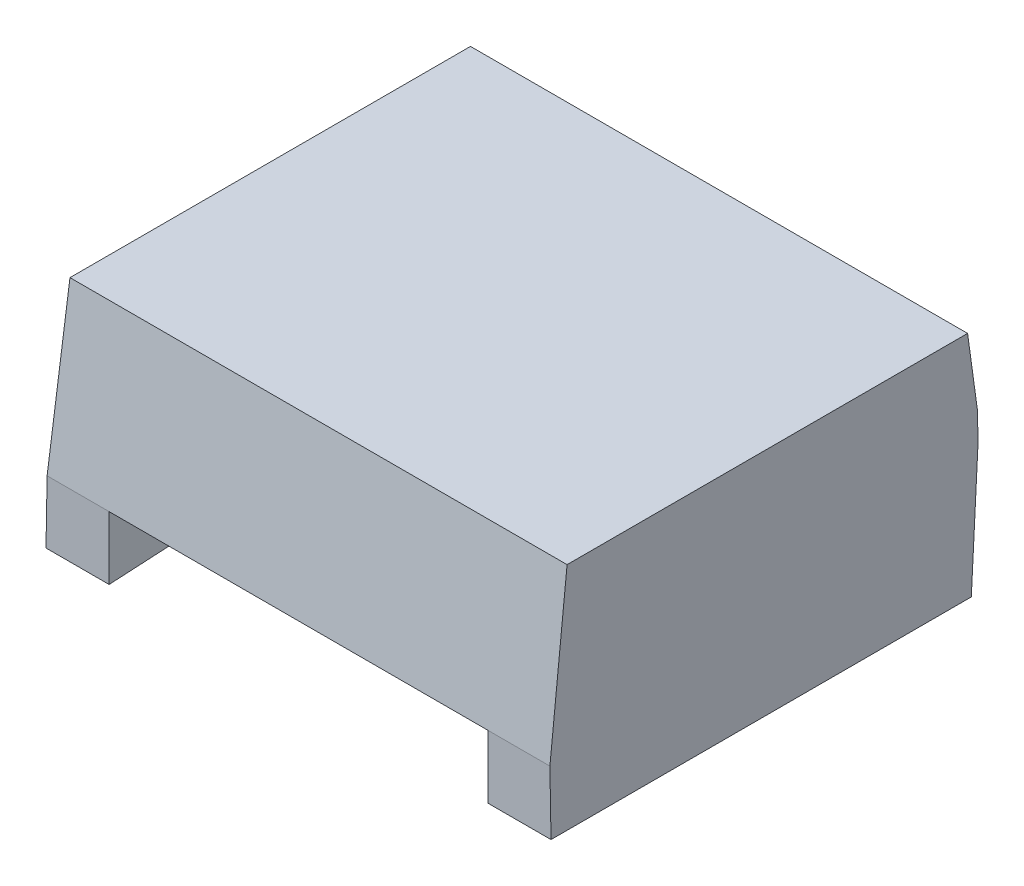
ISO-10303-21;
HEADER;
FILE_DESCRIPTION(('STEP AP214'),'2;1');
FILE_NAME('part.step','',(''),(''),'','','');
FILE_SCHEMA(('AUTOMOTIVE_DESIGN { 1 0 10303 214 1 1 1 1 }'));
ENDSEC;
DATA;
#1=APPLICATION_CONTEXT('core data for automotive mechanical design processes');
#2=APPLICATION_PROTOCOL_DEFINITION('international standard','automotive_design',2000,#1);
#3=PRODUCT_CONTEXT('',#1,'mechanical');
#4=PRODUCT('Part','Part','',(#3));
#5=PRODUCT_RELATED_PRODUCT_CATEGORY('part','',(#4));
#6=PRODUCT_DEFINITION_FORMATION('','',#4);
#7=PRODUCT_DEFINITION_CONTEXT('part definition',#1,'design');
#8=PRODUCT_DEFINITION('design','',#6,#7);
#9=PRODUCT_DEFINITION_SHAPE('','',#8);
#10=(LENGTH_UNIT() NAMED_UNIT(*) SI_UNIT(.MILLI.,.METRE.));
#11=(NAMED_UNIT(*) PLANE_ANGLE_UNIT() SI_UNIT($,.RADIAN.));
#12=(NAMED_UNIT(*) SI_UNIT($,.STERADIAN.) SOLID_ANGLE_UNIT());
#13=UNCERTAINTY_MEASURE_WITH_UNIT(LENGTH_MEASURE(1.E-05),#10,'distance_accuracy_value','');
#14=(GEOMETRIC_REPRESENTATION_CONTEXT(3) GLOBAL_UNCERTAINTY_ASSIGNED_CONTEXT((#13)) GLOBAL_UNIT_ASSIGNED_CONTEXT((#10,
#11,#12)) REPRESENTATION_CONTEXT('',''));
#15=CARTESIAN_POINT('',(0.,0.,0.));
#16=DIRECTION('',(0.,0.,1.));
#17=DIRECTION('',(1.,0.,0.));
#18=AXIS2_PLACEMENT_3D('',#15,#16,#17);
#19=CARTESIAN_POINT('',(3.955,0.,1.55073518027956));
#20=DIRECTION('',(0.998629534754574,0.,0.0523359562429442));
#21=DIRECTION('',(0.0523359562429442,0.,-0.998629534754574));
#22=AXIS2_PLACEMENT_3D('',#19,#20,#21);
#23=PLANE('',#22);
#24=DIRECTION('',(0.0523359562429466,0.,-0.998629534754574));
#25=VECTOR('',#24,1.);
#26=CARTESIAN_POINT('',(3.81,0.,4.3175));
#27=LINE('',#26,#25);
#28=CARTESIAN_POINT('',(3.81,0.,4.3175));
#29=VERTEX_POINT('',#28);
#30=CARTESIAN_POINT('',(4.1,0.,-1.21602963944089));
#31=VERTEX_POINT('',#30);
#32=EDGE_CURVE('E134',#29,#31,#27,.T.);
#33=ORIENTED_EDGE('',*,*,#32,.F.);
#34=DIRECTION('',(0.,1.,0.));
#35=VECTOR('',#34,1.);
#36=CARTESIAN_POINT('',(3.81,0.635,4.3175));
#37=LINE('',#36,#35);
#38=CARTESIAN_POINT('',(3.81,1.27,4.3175));
#39=VERTEX_POINT('',#38);
#40=EDGE_CURVE('E104',#39,#29,#37,.F.);
#41=ORIENTED_EDGE('',*,*,#40,.F.);
#42=DIRECTION('',(0.0523359562429465,0.,-0.998629534754574));
#43=VECTOR('',#42,1.);
#44=CARTESIAN_POINT('',(3.81,1.27,4.3175));
#45=LINE('',#44,#43);
#46=CARTESIAN_POINT('',(4.1,1.27,-1.21602963944089));
#47=VERTEX_POINT('',#46);
#48=EDGE_CURVE('E101',#39,#47,#45,.T.);
#49=ORIENTED_EDGE('',*,*,#48,.T.);
#50=DIRECTION('',(0.,1.,0.));
#51=VECTOR('',#50,1.);
#52=CARTESIAN_POINT('',(4.1,0.,-1.21602963944089));
#53=LINE('',#52,#51);
#54=EDGE_CURVE('E19',#47,#31,#53,.F.);
#55=ORIENTED_EDGE('',*,*,#54,.T.);
#56=EDGE_LOOP('',(#33,#41,#49,#55));
#57=FACE_BOUND('',#56,.T.);
#58=ADVANCED_FACE('F16',(#57),#23,.F.);
#59=CARTESIAN_POINT('',(0.,0.,-1.21602963944089));
#60=DIRECTION('',(0.,0.,-1.));
#61=DIRECTION('',(-1.,0.,0.));
#62=AXIS2_PLACEMENT_3D('',#59,#60,#61);
#63=PLANE('',#62);
#64=DIRECTION('',(1.,0.,0.));
#65=VECTOR('',#64,1.);
#66=CARTESIAN_POINT('',(-5.08,0.,-1.21602963944089));
#67=LINE('',#66,#65);
#68=CARTESIAN_POINT('',(-4.1,0.,-1.21602963944089));
#69=VERTEX_POINT('',#68);
#70=EDGE_CURVE('E112',#31,#69,#67,.F.);
#71=ORIENTED_EDGE('',*,*,#70,.F.);
#72=ORIENTED_EDGE('',*,*,#54,.F.);
#73=DIRECTION('',(1.,0.,0.));
#74=VECTOR('',#73,1.);
#75=CARTESIAN_POINT('',(0.,1.27,-1.21602963944089));
#76=LINE('',#75,#74);
#77=CARTESIAN_POINT('',(-4.1,1.27,-1.21602963944089));
#78=VERTEX_POINT('',#77);
#79=EDGE_CURVE('E96',#47,#78,#76,.F.);
#80=ORIENTED_EDGE('',*,*,#79,.T.);
#81=DIRECTION('',(0.,1.,0.));
#82=VECTOR('',#81,1.);
#83=CARTESIAN_POINT('',(-4.09999999999999,0.,-1.21602963944089));
#84=LINE('',#83,#82);
#85=EDGE_CURVE('E108',#78,#69,#84,.F.);
#86=ORIENTED_EDGE('',*,*,#85,.T.);
#87=EDGE_LOOP('',(#71,#72,#80,#86));
#88=FACE_BOUND('',#87,.T.);
#89=ADVANCED_FACE('F110',(#88),#63,.F.);
#90=CARTESIAN_POINT('',(-3.955,0.,1.55073518027956));
#91=DIRECTION('',(-0.998629534754574,0.,0.052335956242943));
#92=DIRECTION('',(0.052335956242943,0.,0.998629534754574));
#93=AXIS2_PLACEMENT_3D('',#90,#91,#92);
#94=PLANE('',#93);
#95=DIRECTION('',(0.0523359562429447,0.,0.998629534754574));
#96=VECTOR('',#95,1.);
#97=CARTESIAN_POINT('',(-4.1,0.,-1.21602963944089));
#98=LINE('',#97,#96);
#99=CARTESIAN_POINT('',(-3.81000000000001,0.,4.3175));
#100=VERTEX_POINT('',#99);
#101=EDGE_CURVE('E124',#69,#100,#98,.T.);
#102=ORIENTED_EDGE('',*,*,#101,.F.);
#103=ORIENTED_EDGE('',*,*,#85,.F.);
#104=DIRECTION('',(0.0523359562429447,0.,0.998629534754574));
#105=VECTOR('',#104,1.);
#106=CARTESIAN_POINT('',(-4.1,1.27,-1.21602963944089));
#107=LINE('',#106,#105);
#108=CARTESIAN_POINT('',(-3.81000000000001,1.27,4.3175));
#109=VERTEX_POINT('',#108);
#110=EDGE_CURVE('E116',#78,#109,#107,.T.);
#111=ORIENTED_EDGE('',*,*,#110,.T.);
#112=DIRECTION('',(0.,1.,0.));
#113=VECTOR('',#112,1.);
#114=CARTESIAN_POINT('',(-3.81000000000001,0.635,4.3175));
#115=LINE('',#114,#113);
#116=EDGE_CURVE('E118',#100,#109,#115,.T.);
#117=ORIENTED_EDGE('',*,*,#116,.F.);
#118=EDGE_LOOP('',(#102,#103,#111,#117));
#119=FACE_BOUND('',#118,.T.);
#120=ADVANCED_FACE('F125',(#119),#94,.F.);
#121=CARTESIAN_POINT('',(0.,1.27,1.49108501095824));
#122=DIRECTION('',(0.,1.,0.));
#123=DIRECTION('',(0.,0.,1.));
#124=AXIS2_PLACEMENT_3D('',#121,#122,#123);
#125=PLANE('',#124);
#126=ORIENTED_EDGE('',*,*,#79,.F.);
#127=ORIENTED_EDGE('',*,*,#48,.F.);
#128=DIRECTION('',(1.,0.,0.));
#129=VECTOR('',#128,1.);
#130=CARTESIAN_POINT('',(-5.08,1.27,4.3175));
#131=LINE('',#130,#129);
#132=EDGE_CURVE('E151',#109,#39,#131,.T.);
#133=ORIENTED_EDGE('',*,*,#132,.F.);
#134=ORIENTED_EDGE('',*,*,#110,.F.);
#135=EDGE_LOOP('',(#126,#127,#133,#134));
#136=FACE_BOUND('',#135,.T.);
#137=ADVANCED_FACE('F115',(#136),#125,.F.);
#138=CARTESIAN_POINT('',(-5.08,0.635,4.3175));
#139=DIRECTION('',(0.,0.,1.));
#140=DIRECTION('',(1.,0.,0.));
#141=AXIS2_PLACEMENT_3D('',#138,#139,#140);
#142=PLANE('',#141);
#143=ORIENTED_EDGE('',*,*,#116,.T.);
#144=DIRECTION('',(1.,0.,0.));
#145=VECTOR('',#144,1.);
#146=CARTESIAN_POINT('',(-5.08,1.26999999999999,4.31750000000001));
#147=LINE('',#146,#145);
#148=CARTESIAN_POINT('',(-5.0578378021978,1.26999999999999,4.3175));
#149=VERTEX_POINT('',#148);
#150=EDGE_CURVE('E146',#149,#109,#147,.T.);
#151=ORIENTED_EDGE('',*,*,#150,.F.);
#152=DIRECTION('',(-0.0174478930219463,-0.999847773928159,0.));
#153=VECTOR('',#152,1.);
#154=CARTESIAN_POINT('',(-5.0403,2.275,4.3175));
#155=LINE('',#154,#153);
#156=CARTESIAN_POINT('',(-5.08,0.,4.3175));
#157=VERTEX_POINT('',#156);
#158=EDGE_CURVE('E165',#157,#149,#155,.F.);
#159=ORIENTED_EDGE('',*,*,#158,.F.);
#160=DIRECTION('',(1.,0.,0.));
#161=VECTOR('',#160,1.);
#162=CARTESIAN_POINT('',(-5.08,0.,4.3175));
#163=LINE('',#162,#161);
#164=EDGE_CURVE('E129',#100,#157,#163,.F.);
#165=ORIENTED_EDGE('',*,*,#164,.F.);
#166=EDGE_LOOP('',(#143,#151,#159,#165));
#167=FACE_BOUND('',#166,.T.);
#168=ADVANCED_FACE('F144',(#167),#142,.T.);
#169=CARTESIAN_POINT('',(-5.08,1.279375,-4.22803738496977));
#170=DIRECTION('',(0.,-0.0697564737441265,-0.997564050259824));
#171=DIRECTION('',(0.,0.997564050259824,-0.0697564737441265));
#172=AXIS2_PLACEMENT_3D('',#169,#170,#171);
#173=PLANE('',#172);
#174=DIRECTION('',(-0.0174054037231454,0.997412933757608,-0.0697459066488946));
#175=VECTOR('',#174,1.);
#176=CARTESIAN_POINT('',(5.07999999999998,0.,-4.13857476993954));
#177=LINE('',#176,#175);
#178=CARTESIAN_POINT('',(5.07999999999999,0.,-4.13857476993954));
#179=VERTEX_POINT('',#178);
#180=CARTESIAN_POINT('',(5.03534840659341,2.55874999999998,-4.3175));
#181=VERTEX_POINT('',#180);
#182=EDGE_CURVE('E154',#179,#181,#177,.T.);
#183=ORIENTED_EDGE('',*,*,#182,.F.);
#184=DIRECTION('',(1.,0.,0.));
#185=VECTOR('',#184,1.);
#186=CARTESIAN_POINT('',(-5.08,0.,-4.13857476993954));
#187=LINE('',#186,#185);
#188=CARTESIAN_POINT('',(-5.08,0.,-4.13857476993954));
#189=VERTEX_POINT('',#188);
#190=EDGE_CURVE('E178',#189,#179,#187,.T.);
#191=ORIENTED_EDGE('',*,*,#190,.F.);
#192=DIRECTION('',(-0.017405403723146,-0.997412933757608,0.0697459066488944));
#193=VECTOR('',#192,1.);
#194=CARTESIAN_POINT('',(-5.03534840659341,2.55875,-4.3175));
#195=LINE('',#194,#193);
#196=CARTESIAN_POINT('',(-5.03534840659341,2.55874999999999,-4.3175));
#197=VERTEX_POINT('',#196);
#198=EDGE_CURVE('E170',#197,#189,#195,.T.);
#199=ORIENTED_EDGE('',*,*,#198,.F.);
#200=DIRECTION('',(-1.,0.,0.));
#201=VECTOR('',#200,1.);
#202=CARTESIAN_POINT('',(-5.08,2.55874999999999,-4.3175));
#203=LINE('',#202,#201);
#204=EDGE_CURVE('E176',#181,#197,#203,.T.);
#205=ORIENTED_EDGE('',*,*,#204,.F.);
#206=EDGE_LOOP('',(#183,#191,#199,#205));
#207=FACE_BOUND('',#206,.T.);
#208=ADVANCED_FACE('F185',(#207),#173,.T.);
#209=CARTESIAN_POINT('',(-5.08,0.635,4.3175));
#210=DIRECTION('',(0.,0.,1.));
#211=DIRECTION('',(1.,0.,0.));
#212=AXIS2_PLACEMENT_3D('',#209,#210,#211);
#213=PLANE('',#212);
#214=ORIENTED_EDGE('',*,*,#40,.T.);
#215=DIRECTION('',(1.,0.,0.));
#216=VECTOR('',#215,1.);
#217=CARTESIAN_POINT('',(-5.08,0.,4.3175));
#218=LINE('',#217,#216);
#219=CARTESIAN_POINT('',(5.07999999999999,0.,4.3175));
#220=VERTEX_POINT('',#219);
#221=EDGE_CURVE('E136',#220,#29,#218,.F.);
#222=ORIENTED_EDGE('',*,*,#221,.F.);
#223=DIRECTION('',(-0.0174478930219458,0.999847773928159,0.));
#224=VECTOR('',#223,1.);
#225=CARTESIAN_POINT('',(5.0403,2.275,4.3175));
#226=LINE('',#225,#224);
#227=CARTESIAN_POINT('',(5.0578378021978,1.27,4.3175));
#228=VERTEX_POINT('',#227);
#229=EDGE_CURVE('E194',#228,#220,#226,.F.);
#230=ORIENTED_EDGE('',*,*,#229,.F.);
#231=DIRECTION('',(1.,0.,0.));
#232=VECTOR('',#231,1.);
#233=CARTESIAN_POINT('',(-5.08,1.27,4.3175));
#234=LINE('',#233,#232);
#235=EDGE_CURVE('E159',#39,#228,#234,.T.);
#236=ORIENTED_EDGE('',*,*,#235,.F.);
#237=EDGE_LOOP('',(#214,#222,#230,#236));
#238=FACE_BOUND('',#237,.T.);
#239=ADVANCED_FACE('F222',(#238),#213,.T.);
#240=CARTESIAN_POINT('',(-5.08,0.,0.0894626150302302));
#241=DIRECTION('',(0.,-1.,0.));
#242=DIRECTION('',(0.,0.,-1.));
#243=AXIS2_PLACEMENT_3D('',#240,#241,#242);
#244=PLANE('',#243);
#245=DIRECTION('',(0.,0.,1.));
#246=VECTOR('',#245,1.);
#247=CARTESIAN_POINT('',(-5.07999999999998,0.,-0.0656459035782686));
#248=LINE('',#247,#246);
#249=EDGE_CURVE('E167',#189,#157,#248,.T.);
#250=ORIENTED_EDGE('',*,*,#249,.F.);
#251=ORIENTED_EDGE('',*,*,#190,.T.);
#252=DIRECTION('',(0.,0.,1.));
#253=VECTOR('',#252,1.);
#254=CARTESIAN_POINT('',(5.07999999999998,0.,-0.0656459035782686));
#255=LINE('',#254,#253);
#256=EDGE_CURVE('E189',#220,#179,#255,.F.);
#257=ORIENTED_EDGE('',*,*,#256,.F.);
#258=ORIENTED_EDGE('',*,*,#221,.T.);
#259=ORIENTED_EDGE('',*,*,#32,.T.);
#260=ORIENTED_EDGE('',*,*,#70,.T.);
#261=ORIENTED_EDGE('',*,*,#101,.T.);
#262=ORIENTED_EDGE('',*,*,#164,.T.);
#263=EDGE_LOOP('',(#250,#251,#257,#258,#259,#260,#261,#262));
#264=FACE_BOUND('',#263,.T.);
#265=ADVANCED_FACE('F132',(#264),#244,.T.);
#266=CARTESIAN_POINT('',(-5.08,2.84375,-4.3175));
#267=DIRECTION('',(0.,0.,-1.));
#268=DIRECTION('',(-1.,0.,0.));
#269=AXIS2_PLACEMENT_3D('',#266,#267,#268);
#270=PLANE('',#269);
#271=DIRECTION('',(-0.0174478930219458,0.999847773928159,0.));
#272=VECTOR('',#271,1.);
#273=CARTESIAN_POINT('',(5.0403,2.275,-4.3175));
#274=LINE('',#273,#272);
#275=CARTESIAN_POINT('',(5.0254015934066,3.12874999999999,-4.3175));
#276=VERTEX_POINT('',#275);
#277=EDGE_CURVE('E157',#181,#276,#274,.T.);
#278=ORIENTED_EDGE('',*,*,#277,.F.);
#279=ORIENTED_EDGE('',*,*,#204,.T.);
#280=DIRECTION('',(-0.0174478930219463,-0.999847773928159,0.));
#281=VECTOR('',#280,1.);
#282=CARTESIAN_POINT('',(-5.0403,2.275,-4.3175));
#283=LINE('',#282,#281);
#284=CARTESIAN_POINT('',(-5.0254015934066,3.12874999999999,-4.3175));
#285=VERTEX_POINT('',#284);
#286=EDGE_CURVE('E173',#285,#197,#283,.T.);
#287=ORIENTED_EDGE('',*,*,#286,.F.);
#288=DIRECTION('',(1.,0.,0.));
#289=VECTOR('',#288,1.);
#290=CARTESIAN_POINT('',(-5.08,3.12875,-4.3175));
#291=LINE('',#290,#289);
#292=EDGE_CURVE('E206',#276,#285,#291,.F.);
#293=ORIENTED_EDGE('',*,*,#292,.F.);
#294=EDGE_LOOP('',(#278,#279,#287,#293));
#295=FACE_BOUND('',#294,.T.);
#296=ADVANCED_FACE('F207',(#295),#270,.T.);
#297=CARTESIAN_POINT('',(-5.0403,2.275,-0.0656459035782686));
#298=DIRECTION('',(-0.999847773928159,0.0174478930219463,0.));
#299=DIRECTION('',(-0.0174478930219463,-0.999847773928159,0.));
#300=AXIS2_PLACEMENT_3D('',#297,#298,#299);
#301=PLANE('',#300);
#302=ORIENTED_EDGE('',*,*,#249,.T.);
#303=ORIENTED_EDGE('',*,*,#158,.T.);
#304=DIRECTION('',(-0.0173178782239384,-0.992397303764949,0.121851067184006));
#305=VECTOR('',#304,1.);
#306=CARTESIAN_POINT('',(-5.00060000000001,4.55,3.91476664023848));
#307=LINE('',#306,#305);
#308=CARTESIAN_POINT('',(-5.00060000000001,4.55,3.91476664023847));
#309=VERTEX_POINT('',#308);
#310=EDGE_CURVE('E153',#309,#149,#307,.T.);
#311=ORIENTED_EDGE('',*,*,#310,.F.);
#312=DIRECTION('',(0.,0.,1.));
#313=VECTOR('',#312,1.);
#314=CARTESIAN_POINT('',(-5.0006,4.55,-0.114112901289135));
#315=LINE('',#314,#313);
#316=CARTESIAN_POINT('',(-5.00060000000001,4.55,-4.14299244281674));
#317=VERTEX_POINT('',#316);
#318=EDGE_CURVE('E209',#317,#309,#315,.T.);
#319=ORIENTED_EDGE('',*,*,#318,.F.);
#320=DIRECTION('',(0.0173178782239392,0.992397303764948,0.121851067184011));
#321=VECTOR('',#320,1.);
#322=CARTESIAN_POINT('',(-5.02540159340659,3.12875,-4.3175));
#323=LINE('',#322,#321);
#324=EDGE_CURVE('E195',#285,#317,#323,.T.);
#325=ORIENTED_EDGE('',*,*,#324,.F.);
#326=ORIENTED_EDGE('',*,*,#286,.T.);
#327=ORIENTED_EDGE('',*,*,#198,.T.);
#328=EDGE_LOOP('',(#302,#303,#311,#319,#325,#326,#327));
#329=FACE_BOUND('',#328,.T.);
#330=ADVANCED_FACE('F181',(#329),#301,.T.);
#331=CARTESIAN_POINT('',(-5.08,2.91,4.11613332011924));
#332=DIRECTION('',(0.,0.121869343405148,0.992546151641322));
#333=DIRECTION('',(0.,-0.992546151641322,0.121869343405148));
#334=AXIS2_PLACEMENT_3D('',#331,#332,#333);
#335=PLANE('',#334);
#336=ORIENTED_EDGE('',*,*,#310,.T.);
#337=ORIENTED_EDGE('',*,*,#150,.T.);
#338=ORIENTED_EDGE('',*,*,#132,.T.);
#339=ORIENTED_EDGE('',*,*,#235,.T.);
#340=DIRECTION('',(0.0173178782239329,-0.992397303764949,0.121851067184007));
#341=VECTOR('',#340,1.);
#342=CARTESIAN_POINT('',(5.00060000000002,4.55,3.91476664023847));
#343=LINE('',#342,#341);
#344=CARTESIAN_POINT('',(5.00060000000002,4.55,3.91476664023847));
#345=VERTEX_POINT('',#344);
#346=EDGE_CURVE('E199',#345,#228,#343,.T.);
#347=ORIENTED_EDGE('',*,*,#346,.F.);
#348=DIRECTION('',(1.,0.,0.));
#349=VECTOR('',#348,1.);
#350=CARTESIAN_POINT('',(-5.08,4.55,3.91476664023847));
#351=LINE('',#350,#349);
#352=EDGE_CURVE('E216',#309,#345,#351,.T.);
#353=ORIENTED_EDGE('',*,*,#352,.F.);
#354=EDGE_LOOP('',(#336,#337,#338,#339,#347,#353));
#355=FACE_BOUND('',#354,.T.);
#356=ADVANCED_FACE('F150',(#355),#335,.T.);
#357=CARTESIAN_POINT('',(5.0403,2.275,-0.0656459035782686));
#358=DIRECTION('',(0.999847773928159,0.0174478930219458,0.));
#359=DIRECTION('',(-0.0174478930219458,0.999847773928159,0.));
#360=AXIS2_PLACEMENT_3D('',#357,#358,#359);
#361=PLANE('',#360);
#362=ORIENTED_EDGE('',*,*,#229,.T.);
#363=ORIENTED_EDGE('',*,*,#256,.T.);
#364=ORIENTED_EDGE('',*,*,#182,.T.);
#365=ORIENTED_EDGE('',*,*,#277,.T.);
#366=DIRECTION('',(0.0173178782239392,-0.992397303764948,-0.121851067184011));
#367=VECTOR('',#366,1.);
#368=CARTESIAN_POINT('',(5.00060000000001,4.55,-4.14299244281674));
#369=LINE('',#368,#367);
#370=CARTESIAN_POINT('',(5.00060000000002,4.55,-4.14299244281674));
#371=VERTEX_POINT('',#370);
#372=EDGE_CURVE('E34',#371,#276,#369,.T.);
#373=ORIENTED_EDGE('',*,*,#372,.F.);
#374=DIRECTION('',(0.,0.,1.));
#375=VECTOR('',#374,1.);
#376=CARTESIAN_POINT('',(5.00060000000001,4.55,-0.114112901289135));
#377=LINE('',#376,#375);
#378=EDGE_CURVE('E25',#345,#371,#377,.F.);
#379=ORIENTED_EDGE('',*,*,#378,.F.);
#380=ORIENTED_EDGE('',*,*,#346,.T.);
#381=EDGE_LOOP('',(#362,#363,#364,#365,#373,#379,#380));
#382=FACE_BOUND('',#381,.T.);
#383=ADVANCED_FACE('F191',(#382),#361,.T.);
#384=CARTESIAN_POINT('',(-5.08,3.839375,-4.23024622140837));
#385=DIRECTION('',(0.,0.121869343405153,-0.992546151641321));
#386=DIRECTION('',(0.,0.992546151641321,0.121869343405153));
#387=AXIS2_PLACEMENT_3D('',#384,#385,#386);
#388=PLANE('',#387);
#389=ORIENTED_EDGE('',*,*,#372,.T.);
#390=ORIENTED_EDGE('',*,*,#292,.T.);
#391=ORIENTED_EDGE('',*,*,#324,.T.);
#392=DIRECTION('',(1.,0.,0.));
#393=VECTOR('',#392,1.);
#394=CARTESIAN_POINT('',(-5.08,4.55,-4.14299244281674));
#395=LINE('',#394,#393);
#396=EDGE_CURVE('E11',#371,#317,#395,.F.);
#397=ORIENTED_EDGE('',*,*,#396,.F.);
#398=EDGE_LOOP('',(#389,#390,#391,#397));
#399=FACE_BOUND('',#398,.T.);
#400=ADVANCED_FACE('F211',(#399),#388,.T.);
#401=CARTESIAN_POINT('',(-5.08,4.55,-0.114112901289135));
#402=DIRECTION('',(0.,1.,0.));
#403=DIRECTION('',(0.,0.,1.));
#404=AXIS2_PLACEMENT_3D('',#401,#402,#403);
#405=PLANE('',#404);
#406=ORIENTED_EDGE('',*,*,#378,.T.);
#407=ORIENTED_EDGE('',*,*,#396,.T.);
#408=ORIENTED_EDGE('',*,*,#318,.T.);
#409=ORIENTED_EDGE('',*,*,#352,.T.);
#410=EDGE_LOOP('',(#406,#407,#408,#409));
#411=FACE_BOUND('',#410,.T.);
#412=ADVANCED_FACE('F220',(#411),#405,.T.);
#413=CLOSED_SHELL('',(#58,#89,#120,#137,#168,#208,#239,#265,#296,#330,#356,#383,#400,#412));
#414=MANIFOLD_SOLID_BREP('B1',#413);
#415=ADVANCED_BREP_SHAPE_REPRESENTATION('',(#18,#414),#14);
#416=SHAPE_DEFINITION_REPRESENTATION(#9,#415);
ENDSEC;
END-ISO-10303-21;
